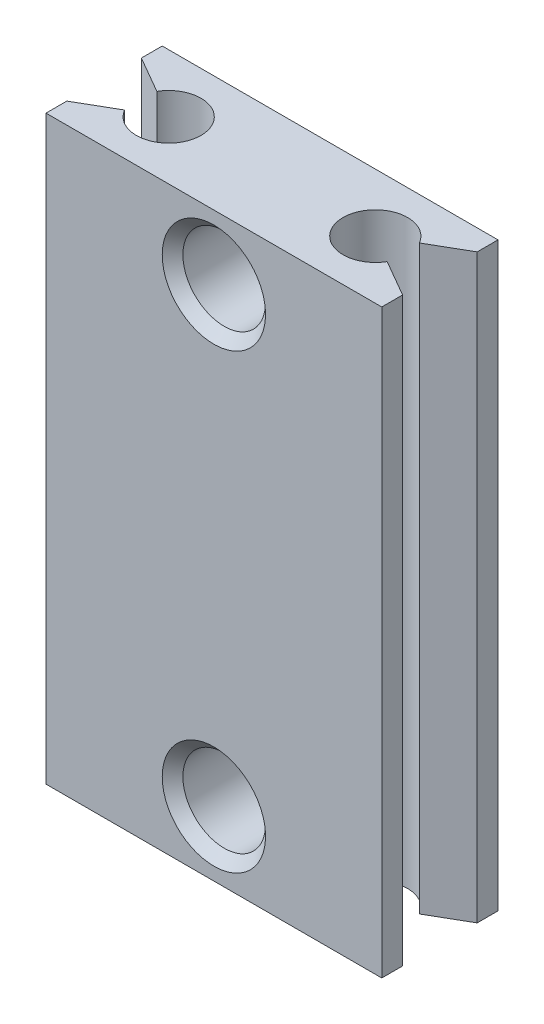
ISO-10303-21;
HEADER;
FILE_DESCRIPTION(('STEP AP214'),'2;1');
FILE_NAME('part.step','',(''),(''),'','','');
FILE_SCHEMA(('AUTOMOTIVE_DESIGN { 1 0 10303 214 1 1 1 1 }'));
ENDSEC;
DATA;
#1=APPLICATION_CONTEXT('core data for automotive mechanical design processes');
#2=APPLICATION_PROTOCOL_DEFINITION('international standard','automotive_design',2000,#1);
#3=PRODUCT_CONTEXT('',#1,'mechanical');
#4=PRODUCT('Part','Part','',(#3));
#5=PRODUCT_RELATED_PRODUCT_CATEGORY('part','',(#4));
#6=PRODUCT_DEFINITION_FORMATION('','',#4);
#7=PRODUCT_DEFINITION_CONTEXT('part definition',#1,'design');
#8=PRODUCT_DEFINITION('design','',#6,#7);
#9=PRODUCT_DEFINITION_SHAPE('','',#8);
#10=(LENGTH_UNIT() NAMED_UNIT(*) SI_UNIT(.MILLI.,.METRE.));
#11=(NAMED_UNIT(*) PLANE_ANGLE_UNIT() SI_UNIT($,.RADIAN.));
#12=(NAMED_UNIT(*) SI_UNIT($,.STERADIAN.) SOLID_ANGLE_UNIT());
#13=UNCERTAINTY_MEASURE_WITH_UNIT(LENGTH_MEASURE(1.E-05),#10,'distance_accuracy_value','');
#14=(GEOMETRIC_REPRESENTATION_CONTEXT(3) GLOBAL_UNCERTAINTY_ASSIGNED_CONTEXT((#13)) GLOBAL_UNIT_ASSIGNED_CONTEXT((#10,
#11,#12)) REPRESENTATION_CONTEXT('',''));
#15=CARTESIAN_POINT('',(0.,0.,0.));
#16=DIRECTION('',(0.,0.,1.));
#17=DIRECTION('',(1.,0.,0.));
#18=AXIS2_PLACEMENT_3D('',#15,#16,#17);
#19=CARTESIAN_POINT('',(-6.5,22.5,4.5));
#20=DIRECTION('',(1.,0.,0.));
#21=DIRECTION('',(0.,0.,-1.));
#22=AXIS2_PLACEMENT_3D('',#19,#20,#21);
#23=PLANE('',#22);
#24=DIRECTION('',(0.,-1.,0.));
#25=VECTOR('',#24,1.);
#26=CARTESIAN_POINT('',(-6.5,22.5,3.69337570992448));
#27=LINE('',#26,#25);
#28=CARTESIAN_POINT('',(-6.5,22.5,3.69337570992448));
#29=VERTEX_POINT('',#28);
#30=CARTESIAN_POINT('',(-6.5,0.,3.69337570992448));
#31=VERTEX_POINT('',#30);
#32=EDGE_CURVE('E122',#29,#31,#27,.T.);
#33=ORIENTED_EDGE('',*,*,#32,.T.);
#34=DIRECTION('',(0.,0.,1.));
#35=VECTOR('',#34,1.);
#36=CARTESIAN_POINT('',(-6.5,0.,4.5));
#37=LINE('',#36,#35);
#38=CARTESIAN_POINT('',(-6.5,0.,4.5));
#39=VERTEX_POINT('',#38);
#40=EDGE_CURVE('E172',#31,#39,#37,.T.);
#41=ORIENTED_EDGE('',*,*,#40,.T.);
#42=DIRECTION('',(0.,-1.,0.));
#43=VECTOR('',#42,1.);
#44=CARTESIAN_POINT('',(-6.5,22.5,4.5));
#45=LINE('',#44,#43);
#46=CARTESIAN_POINT('',(-6.5,22.5,4.5));
#47=VERTEX_POINT('',#46);
#48=EDGE_CURVE('E148',#47,#39,#45,.T.);
#49=ORIENTED_EDGE('',*,*,#48,.F.);
#50=DIRECTION('',(0.,0.,1.));
#51=VECTOR('',#50,1.);
#52=CARTESIAN_POINT('',(-6.5,22.5,4.5));
#53=LINE('',#52,#51);
#54=EDGE_CURVE('E138',#29,#47,#53,.T.);
#55=ORIENTED_EDGE('',*,*,#54,.F.);
#56=EDGE_LOOP('',(#33,#41,#49,#55));
#57=FACE_BOUND('',#56,.T.);
#58=ADVANCED_FACE('F36',(#57),#23,.F.);
#59=DIRECTION('',(0.,-1.,0.));
#60=VECTOR('',#59,1.);
#61=CARTESIAN_POINT('',(-6.5,22.5,0.80662429007552));
#62=LINE('',#61,#60);
#63=CARTESIAN_POINT('',(-6.5,22.5,0.80662429007552));
#64=VERTEX_POINT('',#63);
#65=CARTESIAN_POINT('',(-6.5,0.,0.80662429007552));
#66=VERTEX_POINT('',#65);
#67=EDGE_CURVE('E133',#64,#66,#62,.T.);
#68=ORIENTED_EDGE('',*,*,#67,.F.);
#69=CARTESIAN_POINT('',(-6.5,22.5,0.));
#70=VERTEX_POINT('',#69);
#71=EDGE_CURVE('E149',#70,#64,#53,.T.);
#72=ORIENTED_EDGE('',*,*,#71,.F.);
#73=DIRECTION('',(0.,-1.,0.));
#74=VECTOR('',#73,1.);
#75=CARTESIAN_POINT('',(-6.5,22.5,0.));
#76=LINE('',#75,#74);
#77=CARTESIAN_POINT('',(-6.5,0.,0.));
#78=VERTEX_POINT('',#77);
#79=EDGE_CURVE('E167',#70,#78,#76,.T.);
#80=ORIENTED_EDGE('',*,*,#79,.T.);
#81=EDGE_CURVE('E168',#78,#66,#37,.T.);
#82=ORIENTED_EDGE('',*,*,#81,.T.);
#83=EDGE_LOOP('',(#68,#72,#80,#82));
#84=FACE_BOUND('',#83,.T.);
#85=ADVANCED_FACE('F262',(#84),#23,.F.);
#86=CARTESIAN_POINT('',(6.5,22.5,4.5));
#87=DIRECTION('',(-1.,0.,0.));
#88=DIRECTION('',(0.,0.,1.));
#89=AXIS2_PLACEMENT_3D('',#86,#87,#88);
#90=PLANE('',#89);
#91=DIRECTION('',(0.,-1.,0.));
#92=VECTOR('',#91,1.);
#93=CARTESIAN_POINT('',(6.5,22.5,3.69337570992448));
#94=LINE('',#93,#92);
#95=CARTESIAN_POINT('',(6.5,22.5,3.69337570992448));
#96=VERTEX_POINT('',#95);
#97=CARTESIAN_POINT('',(6.5,0.,3.69337570992448));
#98=VERTEX_POINT('',#97);
#99=EDGE_CURVE('E246',#96,#98,#94,.T.);
#100=ORIENTED_EDGE('',*,*,#99,.F.);
#101=DIRECTION('',(0.,0.,-1.));
#102=VECTOR('',#101,1.);
#103=CARTESIAN_POINT('',(6.5,22.5,4.5));
#104=LINE('',#103,#102);
#105=CARTESIAN_POINT('',(6.5,22.5,4.5));
#106=VERTEX_POINT('',#105);
#107=EDGE_CURVE('E162',#106,#96,#104,.T.);
#108=ORIENTED_EDGE('',*,*,#107,.F.);
#109=DIRECTION('',(0.,-1.,0.));
#110=VECTOR('',#109,1.);
#111=CARTESIAN_POINT('',(6.5,22.5,4.5));
#112=LINE('',#111,#110);
#113=CARTESIAN_POINT('',(6.5,0.,4.5));
#114=VERTEX_POINT('',#113);
#115=EDGE_CURVE('E182',#106,#114,#112,.T.);
#116=ORIENTED_EDGE('',*,*,#115,.T.);
#117=DIRECTION('',(0.,0.,-1.));
#118=VECTOR('',#117,1.);
#119=CARTESIAN_POINT('',(6.5,0.,4.5));
#120=LINE('',#119,#118);
#121=EDGE_CURVE('E154',#114,#98,#120,.T.);
#122=ORIENTED_EDGE('',*,*,#121,.T.);
#123=EDGE_LOOP('',(#100,#108,#116,#122));
#124=FACE_BOUND('',#123,.T.);
#125=ADVANCED_FACE('F245',(#124),#90,.F.);
#126=DIRECTION('',(0.,-1.,0.));
#127=VECTOR('',#126,1.);
#128=CARTESIAN_POINT('',(6.5,22.5,0.806624290075519));
#129=LINE('',#128,#127);
#130=CARTESIAN_POINT('',(6.5,22.5,0.806624290075519));
#131=VERTEX_POINT('',#130);
#132=CARTESIAN_POINT('',(6.5,0.,0.806624290075519));
#133=VERTEX_POINT('',#132);
#134=EDGE_CURVE('E247',#131,#133,#129,.T.);
#135=ORIENTED_EDGE('',*,*,#134,.T.);
#136=CARTESIAN_POINT('',(6.5,0.,0.));
#137=VERTEX_POINT('',#136);
#138=EDGE_CURVE('E174',#133,#137,#120,.T.);
#139=ORIENTED_EDGE('',*,*,#138,.T.);
#140=DIRECTION('',(0.,-1.,0.));
#141=VECTOR('',#140,1.);
#142=CARTESIAN_POINT('',(6.5,22.5,0.));
#143=LINE('',#142,#141);
#144=CARTESIAN_POINT('',(6.5,22.5,0.));
#145=VERTEX_POINT('',#144);
#146=EDGE_CURVE('E179',#145,#137,#143,.T.);
#147=ORIENTED_EDGE('',*,*,#146,.F.);
#148=EDGE_CURVE('E161',#131,#145,#104,.T.);
#149=ORIENTED_EDGE('',*,*,#148,.F.);
#150=EDGE_LOOP('',(#135,#139,#147,#149));
#151=FACE_BOUND('',#150,.T.);
#152=ADVANCED_FACE('F271',(#151),#90,.F.);
#153=CARTESIAN_POINT('',(0.,22.5,0.));
#154=DIRECTION('',(0.,-1.,0.));
#155=DIRECTION('',(0.,0.,-1.));
#156=AXIS2_PLACEMENT_3D('',#153,#154,#155);
#157=PLANE('',#156);
#158=DIRECTION('',(0.866025403784439,0.,-0.5));
#159=VECTOR('',#158,1.);
#160=CARTESIAN_POINT('',(-3.999999936,22.5,2.25));
#161=LINE('',#160,#159);
#162=CARTESIAN_POINT('',(-5.08253169073054,22.5,2.875));
#163=VERTEX_POINT('',#162);
#164=EDGE_CURVE('E125',#29,#163,#161,.T.);
#165=ORIENTED_EDGE('',*,*,#164,.F.);
#166=ORIENTED_EDGE('',*,*,#54,.T.);
#167=DIRECTION('',(1.,0.,0.));
#168=VECTOR('',#167,1.);
#169=CARTESIAN_POINT('',(-6.5,22.5,4.5));
#170=LINE('',#169,#168);
#171=EDGE_CURVE('E153',#47,#106,#170,.T.);
#172=ORIENTED_EDGE('',*,*,#171,.T.);
#173=ORIENTED_EDGE('',*,*,#107,.T.);
#174=DIRECTION('',(0.866025403784439,0.,0.5));
#175=VECTOR('',#174,1.);
#176=CARTESIAN_POINT('',(6.5,22.5,3.69337570992448));
#177=LINE('',#176,#175);
#178=CARTESIAN_POINT('',(5.08253169073054,22.5,2.875));
#179=VERTEX_POINT('',#178);
#180=EDGE_CURVE('E203',#179,#96,#177,.T.);
#181=ORIENTED_EDGE('',*,*,#180,.F.);
#182=CARTESIAN_POINT('',(3.999999936,22.5,2.25));
#183=DIRECTION('',(0.,-1.,0.));
#184=DIRECTION('',(0.,0.,-1.));
#185=AXIS2_PLACEMENT_3D('',#182,#183,#184);
#186=CIRCLE('',#185,1.24999999999999);
#187=CARTESIAN_POINT('',(5.08253169073054,22.5,1.625));
#188=VERTEX_POINT('',#187);
#189=EDGE_CURVE('E206',#179,#188,#186,.T.);
#190=ORIENTED_EDGE('',*,*,#189,.T.);
#191=DIRECTION('',(-0.866025403784438,0.,0.5));
#192=VECTOR('',#191,1.);
#193=CARTESIAN_POINT('',(3.999999936,22.5,2.25));
#194=LINE('',#193,#192);
#195=EDGE_CURVE('E57',#131,#188,#194,.T.);
#196=ORIENTED_EDGE('',*,*,#195,.F.);
#197=ORIENTED_EDGE('',*,*,#148,.T.);
#198=DIRECTION('',(-1.,0.,0.));
#199=VECTOR('',#198,1.);
#200=CARTESIAN_POINT('',(-6.5,22.5,0.));
#201=LINE('',#200,#199);
#202=EDGE_CURVE('E165',#145,#70,#201,.T.);
#203=ORIENTED_EDGE('',*,*,#202,.T.);
#204=ORIENTED_EDGE('',*,*,#71,.T.);
#205=DIRECTION('',(-0.866025403784439,0.,-0.5));
#206=VECTOR('',#205,1.);
#207=CARTESIAN_POINT('',(-6.5,22.5,0.80662429007552));
#208=LINE('',#207,#206);
#209=CARTESIAN_POINT('',(-5.08253169073054,22.5,1.62500000000001));
#210=VERTEX_POINT('',#209);
#211=EDGE_CURVE('E143',#210,#64,#208,.T.);
#212=ORIENTED_EDGE('',*,*,#211,.F.);
#213=CARTESIAN_POINT('',(-3.999999936,22.5,2.25));
#214=DIRECTION('',(0.,-1.,0.));
#215=DIRECTION('',(0.,0.,-1.));
#216=AXIS2_PLACEMENT_3D('',#213,#214,#215);
#217=CIRCLE('',#216,1.24999999999999);
#218=EDGE_CURVE('E142',#210,#163,#217,.T.);
#219=ORIENTED_EDGE('',*,*,#218,.T.);
#220=EDGE_LOOP('',(#165,#166,#172,#173,#181,#190,#196,#197,#203,#204,#212,#219));
#221=FACE_BOUND('',#220,.T.);
#222=ADVANCED_FACE('F137',(#221),#157,.F.);
#223=CARTESIAN_POINT('',(0.,0.,0.));
#224=DIRECTION('',(0.,-1.,0.));
#225=DIRECTION('',(0.,0.,-1.));
#226=AXIS2_PLACEMENT_3D('',#223,#224,#225);
#227=PLANE('',#226);
#228=ORIENTED_EDGE('',*,*,#40,.F.);
#229=DIRECTION('',(0.866025403784439,0.,-0.5));
#230=VECTOR('',#229,1.);
#231=CARTESIAN_POINT('',(-3.999999936,0.,2.25));
#232=LINE('',#231,#230);
#233=CARTESIAN_POINT('',(-5.08253169073054,0.,2.875));
#234=VERTEX_POINT('',#233);
#235=EDGE_CURVE('E128',#31,#234,#232,.T.);
#236=ORIENTED_EDGE('',*,*,#235,.T.);
#237=CARTESIAN_POINT('',(-3.999999936,0.,2.25));
#238=DIRECTION('',(0.,-1.,0.));
#239=DIRECTION('',(0.,0.,-1.));
#240=AXIS2_PLACEMENT_3D('',#237,#238,#239);
#241=CIRCLE('',#240,1.24999999999999);
#242=CARTESIAN_POINT('',(-5.08253169073054,0.,1.62500000000001));
#243=VERTEX_POINT('',#242);
#244=EDGE_CURVE('E132',#243,#234,#241,.T.);
#245=ORIENTED_EDGE('',*,*,#244,.F.);
#246=DIRECTION('',(-0.866025403784439,0.,-0.5));
#247=VECTOR('',#246,1.);
#248=CARTESIAN_POINT('',(-6.5,0.,0.80662429007552));
#249=LINE('',#248,#247);
#250=EDGE_CURVE('E144',#243,#66,#249,.T.);
#251=ORIENTED_EDGE('',*,*,#250,.T.);
#252=ORIENTED_EDGE('',*,*,#81,.F.);
#253=DIRECTION('',(-1.,0.,0.));
#254=VECTOR('',#253,1.);
#255=CARTESIAN_POINT('',(-6.5,0.,0.));
#256=LINE('',#255,#254);
#257=EDGE_CURVE('E150',#137,#78,#256,.T.);
#258=ORIENTED_EDGE('',*,*,#257,.F.);
#259=ORIENTED_EDGE('',*,*,#138,.F.);
#260=DIRECTION('',(-0.866025403784438,0.,0.5));
#261=VECTOR('',#260,1.);
#262=CARTESIAN_POINT('',(3.999999936,0.,2.25));
#263=LINE('',#262,#261);
#264=CARTESIAN_POINT('',(5.08253169073054,0.,1.62500000000001));
#265=VERTEX_POINT('',#264);
#266=EDGE_CURVE('E191',#133,#265,#263,.T.);
#267=ORIENTED_EDGE('',*,*,#266,.T.);
#268=CARTESIAN_POINT('',(3.999999936,0.,2.25));
#269=DIRECTION('',(0.,-1.,0.));
#270=DIRECTION('',(0.,0.,-1.));
#271=AXIS2_PLACEMENT_3D('',#268,#269,#270);
#272=CIRCLE('',#271,1.24999999999999);
#273=CARTESIAN_POINT('',(5.08253169073054,0.,2.875));
#274=VERTEX_POINT('',#273);
#275=EDGE_CURVE('E201',#274,#265,#272,.T.);
#276=ORIENTED_EDGE('',*,*,#275,.F.);
#277=DIRECTION('',(0.866025403784439,0.,0.5));
#278=VECTOR('',#277,1.);
#279=CARTESIAN_POINT('',(6.5,0.,3.69337570992448));
#280=LINE('',#279,#278);
#281=EDGE_CURVE('E49',#274,#98,#280,.T.);
#282=ORIENTED_EDGE('',*,*,#281,.T.);
#283=ORIENTED_EDGE('',*,*,#121,.F.);
#284=DIRECTION('',(1.,0.,0.));
#285=VECTOR('',#284,1.);
#286=CARTESIAN_POINT('',(-6.5,0.,4.5));
#287=LINE('',#286,#285);
#288=EDGE_CURVE('E171',#39,#114,#287,.T.);
#289=ORIENTED_EDGE('',*,*,#288,.F.);
#290=EDGE_LOOP('',(#228,#236,#245,#251,#252,#258,#259,#267,#276,#282,#283,#289));
#291=FACE_BOUND('',#290,.T.);
#292=ADVANCED_FACE('F200',(#291),#227,.T.);
#293=CARTESIAN_POINT('',(3.999999936,0.,2.25));
#294=DIRECTION('',(0.,-1.,0.));
#295=DIRECTION('',(0.,0.,-1.));
#296=AXIS2_PLACEMENT_3D('',#293,#294,#295);
#297=CYLINDRICAL_SURFACE('',#296,1.24999999999999);
#298=DIRECTION('',(0.,-1.,0.));
#299=VECTOR('',#298,1.);
#300=CARTESIAN_POINT('',(5.08253169073054,0.,2.875));
#301=LINE('',#300,#299);
#302=EDGE_CURVE('E11',#274,#179,#301,.F.);
#303=ORIENTED_EDGE('',*,*,#302,.F.);
#304=ORIENTED_EDGE('',*,*,#275,.T.);
#305=DIRECTION('',(0.,-1.,0.));
#306=VECTOR('',#305,1.);
#307=CARTESIAN_POINT('',(5.08253169073054,0.,1.62500000000001));
#308=LINE('',#307,#306);
#309=EDGE_CURVE('E43',#188,#265,#308,.T.);
#310=ORIENTED_EDGE('',*,*,#309,.F.);
#311=ORIENTED_EDGE('',*,*,#189,.F.);
#312=EDGE_LOOP('',(#303,#304,#310,#311));
#313=FACE_BOUND('',#312,.T.);
#314=ADVANCED_FACE('F205',(#313),#297,.F.);
#315=CARTESIAN_POINT('',(-3.999999936,0.,2.25));
#316=DIRECTION('',(0.,-1.,0.));
#317=DIRECTION('',(0.,0.,-1.));
#318=AXIS2_PLACEMENT_3D('',#315,#316,#317);
#319=CYLINDRICAL_SURFACE('',#318,1.24999999999999);
#320=DIRECTION('',(0.,-1.,0.));
#321=VECTOR('',#320,1.);
#322=CARTESIAN_POINT('',(-5.08253169073054,0.,2.875));
#323=LINE('',#322,#321);
#324=EDGE_CURVE('E188',#163,#234,#323,.T.);
#325=ORIENTED_EDGE('',*,*,#324,.F.);
#326=ORIENTED_EDGE('',*,*,#218,.F.);
#327=DIRECTION('',(0.,-1.,0.));
#328=VECTOR('',#327,1.);
#329=CARTESIAN_POINT('',(-5.08253169073054,0.,1.62500000000001));
#330=LINE('',#329,#328);
#331=EDGE_CURVE('E186',#243,#210,#330,.F.);
#332=ORIENTED_EDGE('',*,*,#331,.F.);
#333=ORIENTED_EDGE('',*,*,#244,.T.);
#334=EDGE_LOOP('',(#325,#326,#332,#333));
#335=FACE_BOUND('',#334,.T.);
#336=ADVANCED_FACE('F255',(#335),#319,.F.);
#337=CARTESIAN_POINT('',(-6.5,22.5,4.5));
#338=DIRECTION('',(0.,0.,-1.));
#339=DIRECTION('',(-1.,0.,0.));
#340=AXIS2_PLACEMENT_3D('',#337,#338,#339);
#341=PLANE('',#340);
#342=CARTESIAN_POINT('',(0.,20.,4.5));
#343=DIRECTION('',(0.,0.,-1.));
#344=DIRECTION('',(-1.,0.,0.));
#345=AXIS2_PLACEMENT_3D('',#342,#343,#344);
#346=CIRCLE('',#345,2.);
#347=CARTESIAN_POINT('',(-2.,20.,4.5));
#348=VERTEX_POINT('',#347);
#349=EDGE_CURVE('E208',#348,#348,#346,.T.);
#350=ORIENTED_EDGE('',*,*,#349,.T.);
#351=EDGE_LOOP('',(#350));
#352=FACE_BOUND('',#351,.T.);
#353=CARTESIAN_POINT('',(0.,2.5,4.5));
#354=DIRECTION('',(0.,0.,-1.));
#355=DIRECTION('',(-1.,0.,0.));
#356=AXIS2_PLACEMENT_3D('',#353,#354,#355);
#357=CIRCLE('',#356,2.);
#358=CARTESIAN_POINT('',(-2.,2.5,4.5));
#359=VERTEX_POINT('',#358);
#360=EDGE_CURVE('E224',#359,#359,#357,.T.);
#361=ORIENTED_EDGE('',*,*,#360,.T.);
#362=EDGE_LOOP('',(#361));
#363=FACE_BOUND('',#362,.T.);
#364=ORIENTED_EDGE('',*,*,#288,.T.);
#365=ORIENTED_EDGE('',*,*,#115,.F.);
#366=ORIENTED_EDGE('',*,*,#171,.F.);
#367=ORIENTED_EDGE('',*,*,#48,.T.);
#368=EDGE_LOOP('',(#364,#365,#366,#367));
#369=FACE_BOUND('',#368,.T.);
#370=ADVANCED_FACE('F240',(#352,#363,#369),#341,.F.);
#371=CARTESIAN_POINT('',(-6.5,22.5,0.));
#372=DIRECTION('',(0.,0.,1.));
#373=DIRECTION('',(1.,0.,0.));
#374=AXIS2_PLACEMENT_3D('',#371,#372,#373);
#375=PLANE('',#374);
#376=CARTESIAN_POINT('',(0.,20.,0.));
#377=DIRECTION('',(0.,0.,-1.));
#378=DIRECTION('',(-1.,0.,0.));
#379=AXIS2_PLACEMENT_3D('',#376,#377,#378);
#380=CIRCLE('',#379,2.);
#381=CARTESIAN_POINT('',(-2.,20.,0.));
#382=VERTEX_POINT('',#381);
#383=EDGE_CURVE('E215',#382,#382,#380,.T.);
#384=ORIENTED_EDGE('',*,*,#383,.F.);
#385=EDGE_LOOP('',(#384));
#386=FACE_BOUND('',#385,.T.);
#387=CARTESIAN_POINT('',(0.,2.5,0.));
#388=DIRECTION('',(0.,0.,-1.));
#389=DIRECTION('',(-1.,0.,0.));
#390=AXIS2_PLACEMENT_3D('',#387,#388,#389);
#391=CIRCLE('',#390,2.);
#392=CARTESIAN_POINT('',(-2.,2.5,0.));
#393=VERTEX_POINT('',#392);
#394=EDGE_CURVE('E227',#393,#393,#391,.T.);
#395=ORIENTED_EDGE('',*,*,#394,.F.);
#396=EDGE_LOOP('',(#395));
#397=FACE_BOUND('',#396,.T.);
#398=ORIENTED_EDGE('',*,*,#257,.T.);
#399=ORIENTED_EDGE('',*,*,#79,.F.);
#400=ORIENTED_EDGE('',*,*,#202,.F.);
#401=ORIENTED_EDGE('',*,*,#146,.T.);
#402=EDGE_LOOP('',(#398,#399,#400,#401));
#403=FACE_BOUND('',#402,.T.);
#404=ADVANCED_FACE('F267',(#386,#397,#403),#375,.F.);
#405=CARTESIAN_POINT('',(0.,2.5,4.1));
#406=DIRECTION('',(0.,0.,1.));
#407=DIRECTION('',(1.,0.,0.));
#408=AXIS2_PLACEMENT_3D('',#405,#406,#407);
#409=CONICAL_SURFACE('',#408,1.6,0.785398163397447);
#410=ORIENTED_EDGE('',*,*,#360,.F.);
#411=EDGE_LOOP('',(#410));
#412=FACE_BOUND('',#411,.T.);
#413=CARTESIAN_POINT('',(0.,2.5,4.1));
#414=DIRECTION('',(0.,0.,-1.));
#415=DIRECTION('',(-1.,0.,0.));
#416=AXIS2_PLACEMENT_3D('',#413,#414,#415);
#417=CIRCLE('',#416,1.6);
#418=CARTESIAN_POINT('',(-1.6,2.5,4.1));
#419=VERTEX_POINT('',#418);
#420=EDGE_CURVE('E158',#419,#419,#417,.T.);
#421=ORIENTED_EDGE('',*,*,#420,.T.);
#422=EDGE_LOOP('',(#421));
#423=FACE_BOUND('',#422,.T.);
#424=ADVANCED_FACE('F308',(#412,#423),#409,.F.);
#425=CARTESIAN_POINT('',(0.,2.5,0.));
#426=DIRECTION('',(0.,0.,-1.));
#427=DIRECTION('',(-1.,0.,0.));
#428=AXIS2_PLACEMENT_3D('',#425,#426,#427);
#429=CYLINDRICAL_SURFACE('',#428,1.6);
#430=ORIENTED_EDGE('',*,*,#420,.F.);
#431=EDGE_LOOP('',(#430));
#432=FACE_BOUND('',#431,.T.);
#433=CARTESIAN_POINT('',(0.,2.5,0.400000000000001));
#434=DIRECTION('',(0.,0.,-1.));
#435=DIRECTION('',(-1.,0.,0.));
#436=AXIS2_PLACEMENT_3D('',#433,#434,#435);
#437=CIRCLE('',#436,1.6);
#438=CARTESIAN_POINT('',(-1.6,2.5,0.400000000000001));
#439=VERTEX_POINT('',#438);
#440=EDGE_CURVE('E229',#439,#439,#437,.T.);
#441=ORIENTED_EDGE('',*,*,#440,.T.);
#442=EDGE_LOOP('',(#441));
#443=FACE_BOUND('',#442,.T.);
#444=ADVANCED_FACE('F316',(#432,#443),#429,.F.);
#445=CARTESIAN_POINT('',(0.,2.5,0.));
#446=DIRECTION('',(0.,0.,-1.));
#447=DIRECTION('',(-1.,0.,0.));
#448=AXIS2_PLACEMENT_3D('',#445,#446,#447);
#449=CONICAL_SURFACE('',#448,2.,0.785398163397448);
#450=ORIENTED_EDGE('',*,*,#440,.F.);
#451=EDGE_LOOP('',(#450));
#452=FACE_BOUND('',#451,.T.);
#453=ORIENTED_EDGE('',*,*,#394,.T.);
#454=EDGE_LOOP('',(#453));
#455=FACE_BOUND('',#454,.T.);
#456=ADVANCED_FACE('F321',(#452,#455),#449,.F.);
#457=CARTESIAN_POINT('',(0.,20.,4.1));
#458=DIRECTION('',(0.,0.,1.));
#459=DIRECTION('',(1.,0.,0.));
#460=AXIS2_PLACEMENT_3D('',#457,#458,#459);
#461=CONICAL_SURFACE('',#460,1.6,0.785398163397447);
#462=ORIENTED_EDGE('',*,*,#349,.F.);
#463=EDGE_LOOP('',(#462));
#464=FACE_BOUND('',#463,.T.);
#465=CARTESIAN_POINT('',(0.,20.,4.1));
#466=DIRECTION('',(0.,0.,-1.));
#467=DIRECTION('',(-1.,0.,0.));
#468=AXIS2_PLACEMENT_3D('',#465,#466,#467);
#469=CIRCLE('',#468,1.6);
#470=CARTESIAN_POINT('',(-1.6,20.,4.1));
#471=VERTEX_POINT('',#470);
#472=EDGE_CURVE('E221',#471,#471,#469,.T.);
#473=ORIENTED_EDGE('',*,*,#472,.T.);
#474=EDGE_LOOP('',(#473));
#475=FACE_BOUND('',#474,.T.);
#476=ADVANCED_FACE('F338',(#464,#475),#461,.F.);
#477=CARTESIAN_POINT('',(0.,20.,0.));
#478=DIRECTION('',(0.,0.,-1.));
#479=DIRECTION('',(-1.,0.,0.));
#480=AXIS2_PLACEMENT_3D('',#477,#478,#479);
#481=CYLINDRICAL_SURFACE('',#480,1.6);
#482=ORIENTED_EDGE('',*,*,#472,.F.);
#483=EDGE_LOOP('',(#482));
#484=FACE_BOUND('',#483,.T.);
#485=CARTESIAN_POINT('',(0.,20.,0.400000000000001));
#486=DIRECTION('',(0.,0.,-1.));
#487=DIRECTION('',(-1.,0.,0.));
#488=AXIS2_PLACEMENT_3D('',#485,#486,#487);
#489=CIRCLE('',#488,1.6);
#490=CARTESIAN_POINT('',(-1.6,20.,0.400000000000001));
#491=VERTEX_POINT('',#490);
#492=EDGE_CURVE('E218',#491,#491,#489,.T.);
#493=ORIENTED_EDGE('',*,*,#492,.T.);
#494=EDGE_LOOP('',(#493));
#495=FACE_BOUND('',#494,.T.);
#496=ADVANCED_FACE('F286',(#484,#495),#481,.F.);
#497=CARTESIAN_POINT('',(0.,20.,0.));
#498=DIRECTION('',(0.,0.,-1.));
#499=DIRECTION('',(-1.,0.,0.));
#500=AXIS2_PLACEMENT_3D('',#497,#498,#499);
#501=CONICAL_SURFACE('',#500,2.,0.785398163397448);
#502=ORIENTED_EDGE('',*,*,#492,.F.);
#503=EDGE_LOOP('',(#502));
#504=FACE_BOUND('',#503,.T.);
#505=ORIENTED_EDGE('',*,*,#383,.T.);
#506=EDGE_LOOP('',(#505));
#507=FACE_BOUND('',#506,.T.);
#508=ADVANCED_FACE('F279',(#504,#507),#501,.F.);
#509=CARTESIAN_POINT('',(-6.5,22.5,0.80662429007552));
#510=DIRECTION('',(-0.5,0.,0.866025403784439));
#511=DIRECTION('',(0.866025403784439,0.,0.5));
#512=AXIS2_PLACEMENT_3D('',#509,#510,#511);
#513=PLANE('',#512);
#514=ORIENTED_EDGE('',*,*,#331,.T.);
#515=ORIENTED_EDGE('',*,*,#211,.T.);
#516=ORIENTED_EDGE('',*,*,#67,.T.);
#517=ORIENTED_EDGE('',*,*,#250,.F.);
#518=EDGE_LOOP('',(#514,#515,#516,#517));
#519=FACE_BOUND('',#518,.T.);
#520=ADVANCED_FACE('F277',(#519),#513,.T.);
#521=CARTESIAN_POINT('',(-3.999999936,22.5,2.25));
#522=DIRECTION('',(-0.5,0.,-0.866025403784439));
#523=DIRECTION('',(-0.866025403784439,0.,0.5));
#524=AXIS2_PLACEMENT_3D('',#521,#522,#523);
#525=PLANE('',#524);
#526=ORIENTED_EDGE('',*,*,#324,.T.);
#527=ORIENTED_EDGE('',*,*,#235,.F.);
#528=ORIENTED_EDGE('',*,*,#32,.F.);
#529=ORIENTED_EDGE('',*,*,#164,.T.);
#530=EDGE_LOOP('',(#526,#527,#528,#529));
#531=FACE_BOUND('',#530,.T.);
#532=ADVANCED_FACE('F124',(#531),#525,.T.);
#533=CARTESIAN_POINT('',(3.999999936,22.5,2.25));
#534=DIRECTION('',(0.5,0.,0.866025403784438));
#535=DIRECTION('',(0.866025403784439,0.,-0.5));
#536=AXIS2_PLACEMENT_3D('',#533,#534,#535);
#537=PLANE('',#536);
#538=ORIENTED_EDGE('',*,*,#309,.T.);
#539=ORIENTED_EDGE('',*,*,#266,.F.);
#540=ORIENTED_EDGE('',*,*,#134,.F.);
#541=ORIENTED_EDGE('',*,*,#195,.T.);
#542=EDGE_LOOP('',(#538,#539,#540,#541));
#543=FACE_BOUND('',#542,.T.);
#544=ADVANCED_FACE('F190',(#543),#537,.T.);
#545=CARTESIAN_POINT('',(6.5,22.5,3.69337570992448));
#546=DIRECTION('',(0.5,0.,-0.866025403784439));
#547=DIRECTION('',(-0.866025403784439,0.,-0.5));
#548=AXIS2_PLACEMENT_3D('',#545,#546,#547);
#549=PLANE('',#548);
#550=ORIENTED_EDGE('',*,*,#302,.T.);
#551=ORIENTED_EDGE('',*,*,#180,.T.);
#552=ORIENTED_EDGE('',*,*,#99,.T.);
#553=ORIENTED_EDGE('',*,*,#281,.F.);
#554=EDGE_LOOP('',(#550,#551,#552,#553));
#555=FACE_BOUND('',#554,.T.);
#556=ADVANCED_FACE('F423',(#555),#549,.T.);
#557=CLOSED_SHELL('',(#58,#85,#125,#152,#222,#292,#314,#336,#370,#404,#424,#444,#456,#476,#496,
#508,#520,#532,#544,#556));
#558=MANIFOLD_SOLID_BREP('B2',#557);
#559=ADVANCED_BREP_SHAPE_REPRESENTATION('',(#18,#558),#14);
#560=SHAPE_DEFINITION_REPRESENTATION(#9,#559);
ENDSEC;
END-ISO-10303-21;
